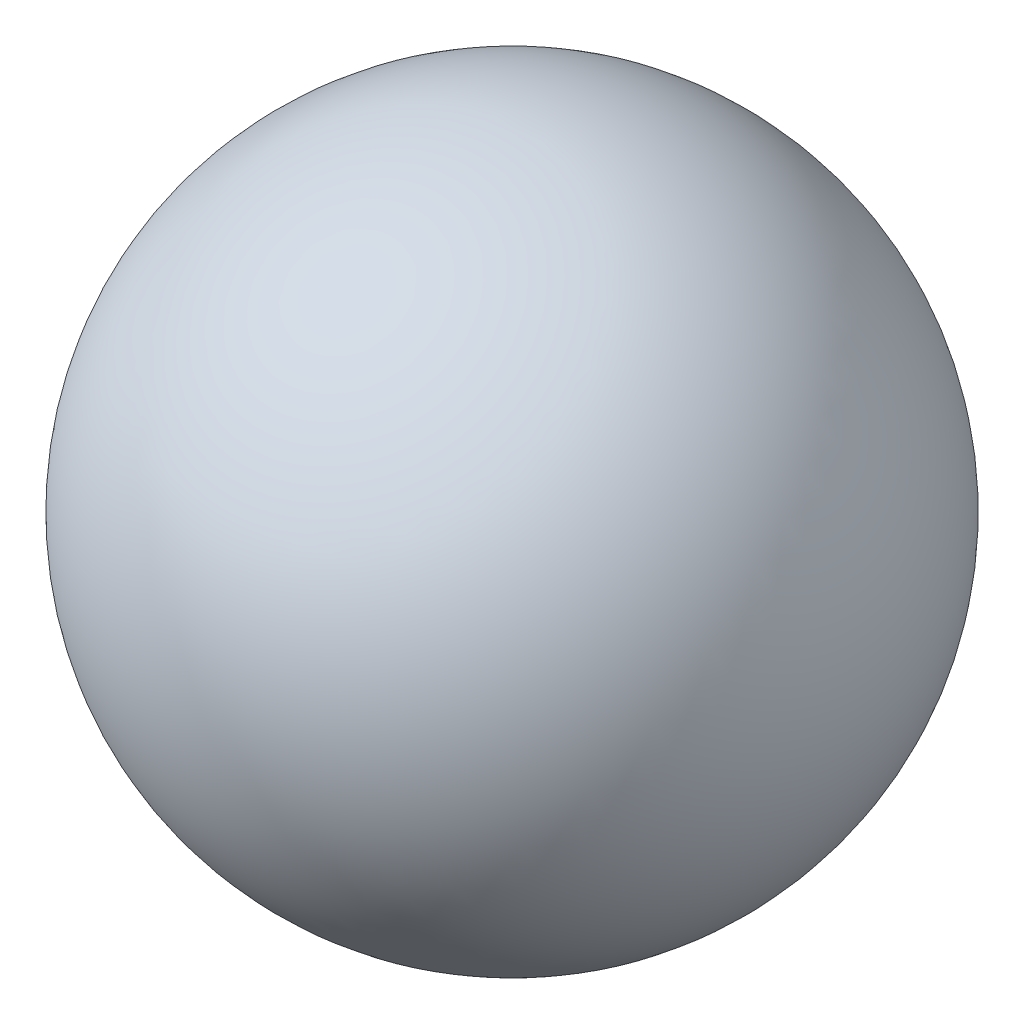
ISO-10303-21;
HEADER;
FILE_DESCRIPTION(('STEP AP214'),'2;1');
FILE_NAME('part.step','',(''),(''),'','','');
FILE_SCHEMA(('AUTOMOTIVE_DESIGN { 1 0 10303 214 1 1 1 1 }'));
ENDSEC;
DATA;
#1=APPLICATION_CONTEXT('core data for automotive mechanical design processes');
#2=APPLICATION_PROTOCOL_DEFINITION('international standard','automotive_design',2000,#1);
#3=PRODUCT_CONTEXT('',#1,'mechanical');
#4=PRODUCT('Part','Part','',(#3));
#5=PRODUCT_RELATED_PRODUCT_CATEGORY('part','',(#4));
#6=PRODUCT_DEFINITION_FORMATION('','',#4);
#7=PRODUCT_DEFINITION_CONTEXT('part definition',#1,'design');
#8=PRODUCT_DEFINITION('design','',#6,#7);
#9=PRODUCT_DEFINITION_SHAPE('','',#8);
#10=(LENGTH_UNIT() NAMED_UNIT(*) SI_UNIT(.MILLI.,.METRE.));
#11=(NAMED_UNIT(*) PLANE_ANGLE_UNIT() SI_UNIT($,.RADIAN.));
#12=(NAMED_UNIT(*) SI_UNIT($,.STERADIAN.) SOLID_ANGLE_UNIT());
#13=UNCERTAINTY_MEASURE_WITH_UNIT(LENGTH_MEASURE(1.E-05),#10,'distance_accuracy_value','');
#14=(GEOMETRIC_REPRESENTATION_CONTEXT(3) GLOBAL_UNCERTAINTY_ASSIGNED_CONTEXT((#13)) GLOBAL_UNIT_ASSIGNED_CONTEXT((#10,
#11,#12)) REPRESENTATION_CONTEXT('',''));
#15=CARTESIAN_POINT('',(0.,0.,0.));
#16=DIRECTION('',(0.,0.,1.));
#17=DIRECTION('',(1.,0.,0.));
#18=AXIS2_PLACEMENT_3D('',#15,#16,#17);
#19=CARTESIAN_POINT('',(0.,0.,0.));
#20=DIRECTION('',(0.,1.,0.));
#21=DIRECTION('',(1.,0.,0.));
#22=AXIS2_PLACEMENT_3D('',#19,#20,#21);
#23=SPHERICAL_SURFACE('',#22,7.5);
#24=CARTESIAN_POINT('',(0.,7.5,0.));
#25=VERTEX_POINT('',#24);
#26=VERTEX_LOOP('',#25);
#27=FACE_BOUND('',#26,.T.);
#28=ADVANCED_FACE('F35',(#27),#23,.T.);
#29=CLOSED_SHELL('',(#28));
#30=MANIFOLD_SOLID_BREP('B2',#29);
#31=ADVANCED_BREP_SHAPE_REPRESENTATION('',(#18,#30),#14);
#32=SHAPE_DEFINITION_REPRESENTATION(#9,#31);
ENDSEC;
END-ISO-10303-21;
